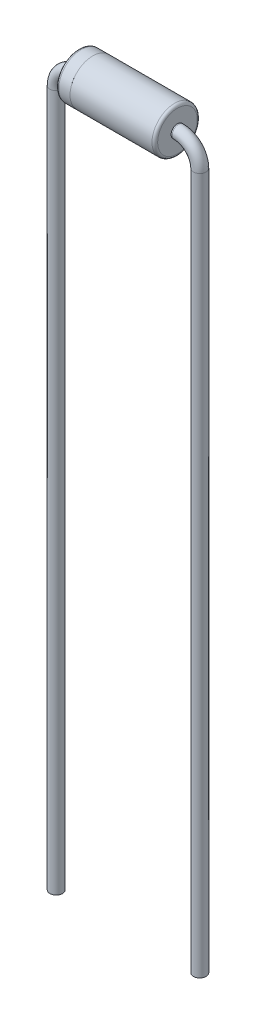
ISO-10303-21;
HEADER;
FILE_DESCRIPTION(('STEP AP214'),'2;1');
FILE_NAME('part.step','',(''),(''),'','','');
FILE_SCHEMA(('AUTOMOTIVE_DESIGN { 1 0 10303 214 1 1 1 1 }'));
ENDSEC;
DATA;
#1=APPLICATION_CONTEXT('core data for automotive mechanical design processes');
#2=APPLICATION_PROTOCOL_DEFINITION('international standard','automotive_design',2000,#1);
#3=PRODUCT_CONTEXT('',#1,'mechanical');
#4=PRODUCT('Part','Part','',(#3));
#5=PRODUCT_RELATED_PRODUCT_CATEGORY('part','',(#4));
#6=PRODUCT_DEFINITION_FORMATION('','',#4);
#7=PRODUCT_DEFINITION_CONTEXT('part definition',#1,'design');
#8=PRODUCT_DEFINITION('design','',#6,#7);
#9=PRODUCT_DEFINITION_SHAPE('','',#8);
#10=(LENGTH_UNIT() NAMED_UNIT(*) SI_UNIT(.MILLI.,.METRE.));
#11=(NAMED_UNIT(*) PLANE_ANGLE_UNIT() SI_UNIT($,.RADIAN.));
#12=(NAMED_UNIT(*) SI_UNIT($,.STERADIAN.) SOLID_ANGLE_UNIT());
#13=UNCERTAINTY_MEASURE_WITH_UNIT(LENGTH_MEASURE(1.E-05),#10,'distance_accuracy_value','');
#14=(GEOMETRIC_REPRESENTATION_CONTEXT(3) GLOBAL_UNCERTAINTY_ASSIGNED_CONTEXT((#13)) GLOBAL_UNIT_ASSIGNED_CONTEXT((#10,
#11,#12)) REPRESENTATION_CONTEXT('',''));
#15=CARTESIAN_POINT('',(0.,0.,0.));
#16=DIRECTION('',(0.,0.,1.));
#17=DIRECTION('',(1.,0.,0.));
#18=AXIS2_PLACEMENT_3D('',#15,#16,#17);
#19=CARTESIAN_POINT('',(-1.25,0.,0.));
#20=DIRECTION('',(1.,0.,0.));
#21=DIRECTION('',(0.,1.,0.));
#22=AXIS2_PLACEMENT_3D('',#19,#20,#21);
#23=PLANE('',#22);
#24=CARTESIAN_POINT('',(-1.25,0.,0.));
#25=DIRECTION('',(1.,0.,0.));
#26=DIRECTION('',(0.,1.,0.));
#27=AXIS2_PLACEMENT_3D('',#24,#25,#26);
#28=CIRCLE('',#27,0.8);
#29=CARTESIAN_POINT('',(-1.25,0.8,0.));
#30=VERTEX_POINT('',#29);
#31=EDGE_CURVE('E11',#30,#30,#28,.T.);
#32=ORIENTED_EDGE('',*,*,#31,.T.);
#33=EDGE_LOOP('',(#32));
#34=FACE_BOUND('',#33,.T.);
#35=ADVANCED_FACE('F45',(#34),#23,.T.);
#36=CARTESIAN_POINT('',(-1.25,0.,0.));
#37=DIRECTION('',(1.,0.,0.));
#38=DIRECTION('',(0.,1.,0.));
#39=AXIS2_PLACEMENT_3D('',#36,#37,#38);
#40=CYLINDRICAL_SURFACE('',#39,0.8);
#41=CARTESIAN_POINT('',(-1.65,0.,0.));
#42=DIRECTION('',(1.,0.,0.));
#43=DIRECTION('',(0.,1.,0.));
#44=AXIS2_PLACEMENT_3D('',#41,#42,#43);
#45=CIRCLE('',#44,0.8);
#46=CARTESIAN_POINT('',(-1.65,0.8,0.));
#47=VERTEX_POINT('',#46);
#48=EDGE_CURVE('E52',#47,#47,#45,.T.);
#49=ORIENTED_EDGE('',*,*,#48,.T.);
#50=EDGE_LOOP('',(#49));
#51=FACE_BOUND('',#50,.T.);
#52=ORIENTED_EDGE('',*,*,#31,.F.);
#53=EDGE_LOOP('',(#52));
#54=FACE_BOUND('',#53,.T.);
#55=ADVANCED_FACE('F116',(#51,#54),#40,.T.);
#56=CARTESIAN_POINT('',(-1.65,0.,0.));
#57=DIRECTION('',(1.,0.,0.));
#58=DIRECTION('',(0.,1.,0.));
#59=AXIS2_PLACEMENT_3D('',#56,#57,#58);
#60=TOROIDAL_SURFACE('',#59,0.7,0.1);
#61=CARTESIAN_POINT('',(-1.75,0.,0.));
#62=DIRECTION('',(1.,0.,0.));
#63=DIRECTION('',(0.,1.,0.));
#64=AXIS2_PLACEMENT_3D('',#61,#62,#63);
#65=CIRCLE('',#64,0.699999999999999);
#66=CARTESIAN_POINT('',(-1.75,0.699999999999999,0.));
#67=VERTEX_POINT('',#66);
#68=EDGE_CURVE('E56',#67,#67,#65,.T.);
#69=ORIENTED_EDGE('',*,*,#68,.T.);
#70=EDGE_LOOP('',(#69));
#71=FACE_BOUND('',#70,.T.);
#72=ORIENTED_EDGE('',*,*,#48,.F.);
#73=EDGE_LOOP('',(#72));
#74=FACE_BOUND('',#73,.T.);
#75=ADVANCED_FACE('F113',(#71,#74),#60,.T.);
#76=CARTESIAN_POINT('',(-1.75,0.,0.));
#77=DIRECTION('',(-1.,0.,0.));
#78=DIRECTION('',(0.,-1.,0.));
#79=AXIS2_PLACEMENT_3D('',#76,#77,#78);
#80=PLANE('',#79);
#81=ORIENTED_EDGE('',*,*,#68,.F.);
#82=EDGE_LOOP('',(#81));
#83=FACE_BOUND('',#82,.T.);
#84=ADVANCED_FACE('F110',(#83),#80,.T.);
#85=CLOSED_SHELL('',(#35,#55,#75,#84));
#86=CARTESIAN_POINT('',(-1.33,0.08,0.));
#87=DIRECTION('',(1.,0.,0.));
#88=DIRECTION('',(0.,1.,0.));
#89=AXIS2_PLACEMENT_3D('',#86,#87,#88);
#90=PLANE('',#89);
#91=CARTESIAN_POINT('',(-1.33,0.,0.));
#92=DIRECTION('',(1.,0.,0.));
#93=DIRECTION('',(0.,1.,0.));
#94=AXIS2_PLACEMENT_3D('',#91,#92,#93);
#95=CIRCLE('',#94,0.72);
#96=CARTESIAN_POINT('',(-1.33,0.72,0.));
#97=VERTEX_POINT('',#96);
#98=EDGE_CURVE('E74',#97,#97,#95,.T.);
#99=ORIENTED_EDGE('',*,*,#98,.F.);
#100=EDGE_LOOP('',(#99));
#101=FACE_BOUND('',#100,.T.);
#102=CARTESIAN_POINT('',(-1.33,0.,0.));
#103=DIRECTION('',(1.,0.,0.));
#104=DIRECTION('',(0.,1.,0.));
#105=AXIS2_PLACEMENT_3D('',#102,#103,#104);
#106=CIRCLE('',#105,0.08);
#107=CARTESIAN_POINT('',(-1.33,0.08,0.));
#108=VERTEX_POINT('',#107);
#109=EDGE_CURVE('E60',#108,#108,#106,.T.);
#110=ORIENTED_EDGE('',*,*,#109,.T.);
#111=EDGE_LOOP('',(#110));
#112=FACE_BOUND('',#111,.T.);
#113=ADVANCED_FACE('F80',(#101,#112),#90,.F.);
#114=CARTESIAN_POINT('',(-1.25,0.,0.));
#115=DIRECTION('',(1.,0.,0.));
#116=DIRECTION('',(0.,1.,0.));
#117=AXIS2_PLACEMENT_3D('',#114,#115,#116);
#118=CYLINDRICAL_SURFACE('',#117,0.08);
#119=ORIENTED_EDGE('',*,*,#109,.F.);
#120=EDGE_LOOP('',(#119));
#121=FACE_BOUND('',#120,.T.);
#122=CARTESIAN_POINT('',(-1.67,0.,0.));
#123=DIRECTION('',(1.,0.,0.));
#124=DIRECTION('',(0.,1.,0.));
#125=AXIS2_PLACEMENT_3D('',#122,#123,#124);
#126=CIRCLE('',#125,0.0800000000000001);
#127=CARTESIAN_POINT('',(-1.67,0.08,0.));
#128=VERTEX_POINT('',#127);
#129=EDGE_CURVE('E65',#128,#128,#126,.T.);
#130=ORIENTED_EDGE('',*,*,#129,.T.);
#131=EDGE_LOOP('',(#130));
#132=FACE_BOUND('',#131,.T.);
#133=ADVANCED_FACE('F83',(#121,#132),#118,.T.);
#134=CARTESIAN_POINT('',(-1.67,0.08,0.));
#135=DIRECTION('',(-1.,0.,0.));
#136=DIRECTION('',(0.,-1.,0.));
#137=AXIS2_PLACEMENT_3D('',#134,#135,#136);
#138=PLANE('',#137);
#139=ORIENTED_EDGE('',*,*,#129,.F.);
#140=EDGE_LOOP('',(#139));
#141=FACE_BOUND('',#140,.T.);
#142=CARTESIAN_POINT('',(-1.67,0.,0.));
#143=DIRECTION('',(1.,0.,0.));
#144=DIRECTION('',(0.,1.,0.));
#145=AXIS2_PLACEMENT_3D('',#142,#143,#144);
#146=CIRCLE('',#145,0.7);
#147=CARTESIAN_POINT('',(-1.67,0.7,0.));
#148=VERTEX_POINT('',#147);
#149=EDGE_CURVE('E68',#148,#148,#146,.T.);
#150=ORIENTED_EDGE('',*,*,#149,.T.);
#151=EDGE_LOOP('',(#150));
#152=FACE_BOUND('',#151,.T.);
#153=ADVANCED_FACE('F90',(#141,#152),#138,.F.);
#154=CARTESIAN_POINT('',(-1.65,0.,0.));
#155=DIRECTION('',(1.,0.,0.));
#156=DIRECTION('',(0.,1.,0.));
#157=AXIS2_PLACEMENT_3D('',#154,#155,#156);
#158=TOROIDAL_SURFACE('',#157,0.7,0.0200000000000001);
#159=ORIENTED_EDGE('',*,*,#149,.F.);
#160=EDGE_LOOP('',(#159));
#161=FACE_BOUND('',#160,.T.);
#162=CARTESIAN_POINT('',(-1.65,0.,0.));
#163=DIRECTION('',(1.,0.,0.));
#164=DIRECTION('',(0.,1.,0.));
#165=AXIS2_PLACEMENT_3D('',#162,#163,#164);
#166=CIRCLE('',#165,0.72);
#167=CARTESIAN_POINT('',(-1.65,0.72,0.));
#168=VERTEX_POINT('',#167);
#169=EDGE_CURVE('E71',#168,#168,#166,.T.);
#170=ORIENTED_EDGE('',*,*,#169,.T.);
#171=EDGE_LOOP('',(#170));
#172=FACE_BOUND('',#171,.T.);
#173=ADVANCED_FACE('F96',(#161,#172),#158,.F.);
#174=CARTESIAN_POINT('',(-1.25,0.,0.));
#175=DIRECTION('',(1.,0.,0.));
#176=DIRECTION('',(0.,1.,0.));
#177=AXIS2_PLACEMENT_3D('',#174,#175,#176);
#178=CYLINDRICAL_SURFACE('',#177,0.72);
#179=ORIENTED_EDGE('',*,*,#169,.F.);
#180=EDGE_LOOP('',(#179));
#181=FACE_BOUND('',#180,.T.);
#182=ORIENTED_EDGE('',*,*,#98,.T.);
#183=EDGE_LOOP('',(#182));
#184=FACE_BOUND('',#183,.T.);
#185=ADVANCED_FACE('F78',(#181,#184),#178,.F.);
#186=CLOSED_SHELL('',(#113,#133,#153,#173,#185));
#187=ORIENTED_CLOSED_SHELL('',*,#186,.T.);
#188=BREP_WITH_VOIDS('B2',#85,(#187));
#189=CARTESIAN_POINT('',(1.75,0.699999999999999,0.));
#190=DIRECTION('',(-1.,0.,0.));
#191=DIRECTION('',(0.,0.,1.));
#192=AXIS2_PLACEMENT_3D('',#189,#190,#191);
#193=PLANE('',#192);
#194=CARTESIAN_POINT('',(1.75,0.,0.));
#195=DIRECTION('',(-1.,0.,0.));
#196=DIRECTION('',(0.,0.,1.));
#197=AXIS2_PLACEMENT_3D('',#194,#195,#196);
#198=CIRCLE('',#197,0.699999999999999);
#199=CARTESIAN_POINT('',(1.75,0.,0.699999999999999));
#200=VERTEX_POINT('',#199);
#201=EDGE_CURVE('E196',#200,#200,#198,.T.);
#202=ORIENTED_EDGE('',*,*,#201,.F.);
#203=EDGE_LOOP('',(#202));
#204=FACE_BOUND('',#203,.T.);
#205=ADVANCED_FACE('F186',(#204),#193,.F.);
#206=CARTESIAN_POINT('',(-1.25,0.,0.));
#207=DIRECTION('',(1.,0.,0.));
#208=DIRECTION('',(0.,0.,-1.));
#209=AXIS2_PLACEMENT_3D('',#206,#207,#208);
#210=PLANE('',#209);
#211=CARTESIAN_POINT('',(-1.25,0.,0.));
#212=DIRECTION('',(-1.,0.,0.));
#213=DIRECTION('',(0.,0.,1.));
#214=AXIS2_PLACEMENT_3D('',#211,#212,#213);
#215=CIRCLE('',#214,0.8);
#216=CARTESIAN_POINT('',(-1.25,0.,0.8));
#217=VERTEX_POINT('',#216);
#218=EDGE_CURVE('E43',#217,#217,#215,.T.);
#219=ORIENTED_EDGE('',*,*,#218,.T.);
#220=EDGE_LOOP('',(#219));
#221=FACE_BOUND('',#220,.T.);
#222=ADVANCED_FACE('F206',(#221),#210,.F.);
#223=CARTESIAN_POINT('',(-1.25,0.,0.));
#224=DIRECTION('',(-1.,0.,0.));
#225=DIRECTION('',(0.,0.,1.));
#226=AXIS2_PLACEMENT_3D('',#223,#224,#225);
#227=CYLINDRICAL_SURFACE('',#226,0.8);
#228=ORIENTED_EDGE('',*,*,#218,.F.);
#229=EDGE_LOOP('',(#228));
#230=FACE_BOUND('',#229,.T.);
#231=CARTESIAN_POINT('',(1.65,0.,0.));
#232=DIRECTION('',(-1.,0.,0.));
#233=DIRECTION('',(0.,0.,1.));
#234=AXIS2_PLACEMENT_3D('',#231,#232,#233);
#235=CIRCLE('',#234,0.8);
#236=CARTESIAN_POINT('',(1.65,0.,0.8));
#237=VERTEX_POINT('',#236);
#238=EDGE_CURVE('E192',#237,#237,#235,.T.);
#239=ORIENTED_EDGE('',*,*,#238,.T.);
#240=EDGE_LOOP('',(#239));
#241=FACE_BOUND('',#240,.T.);
#242=ADVANCED_FACE('F210',(#230,#241),#227,.T.);
#243=CARTESIAN_POINT('',(1.65,0.,0.));
#244=DIRECTION('',(-1.,0.,0.));
#245=DIRECTION('',(0.,0.,1.));
#246=AXIS2_PLACEMENT_3D('',#243,#244,#245);
#247=TOROIDAL_SURFACE('',#246,0.7,0.1);
#248=ORIENTED_EDGE('',*,*,#238,.F.);
#249=EDGE_LOOP('',(#248));
#250=FACE_BOUND('',#249,.T.);
#251=ORIENTED_EDGE('',*,*,#201,.T.);
#252=EDGE_LOOP('',(#251));
#253=FACE_BOUND('',#252,.T.);
#254=ADVANCED_FACE('F203',(#250,#253),#247,.T.);
#255=CLOSED_SHELL('',(#205,#222,#242,#254));
#256=MANIFOLD_SOLID_BREP('B6',#255);
#257=CARTESIAN_POINT('',(1.5,0.4,0.));
#258=DIRECTION('',(-1.,0.,0.));
#259=DIRECTION('',(0.,0.,1.));
#260=AXIS2_PLACEMENT_3D('',#257,#258,#259);
#261=PLANE('',#260);
#262=CARTESIAN_POINT('',(1.5,0.,0.));
#263=DIRECTION('',(-1.,0.,0.));
#264=DIRECTION('',(0.,0.,1.));
#265=AXIS2_PLACEMENT_3D('',#262,#263,#264);
#266=CIRCLE('',#265,0.4);
#267=CARTESIAN_POINT('',(1.5,0.,0.4));
#268=VERTEX_POINT('',#267);
#269=EDGE_CURVE('E185',#268,#268,#266,.T.);
#270=ORIENTED_EDGE('',*,*,#269,.F.);
#271=EDGE_LOOP('',(#270));
#272=FACE_BOUND('',#271,.T.);
#273=ADVANCED_FACE('F249',(#272),#261,.F.);
#274=CARTESIAN_POINT('',(1.4,0.,0.));
#275=DIRECTION('',(-1.,0.,0.));
#276=DIRECTION('',(0.,0.,1.));
#277=AXIS2_PLACEMENT_3D('',#274,#275,#276);
#278=TOROIDAL_SURFACE('',#277,0.4,0.1);
#279=CARTESIAN_POINT('',(1.4,0.,0.));
#280=DIRECTION('',(-1.,0.,0.));
#281=DIRECTION('',(0.,0.,1.));
#282=AXIS2_PLACEMENT_3D('',#279,#280,#281);
#283=CIRCLE('',#282,0.5);
#284=CARTESIAN_POINT('',(1.4,0.,0.5));
#285=VERTEX_POINT('',#284);
#286=EDGE_CURVE('E255',#285,#285,#283,.T.);
#287=ORIENTED_EDGE('',*,*,#286,.F.);
#288=EDGE_LOOP('',(#287));
#289=FACE_BOUND('',#288,.T.);
#290=ORIENTED_EDGE('',*,*,#269,.T.);
#291=EDGE_LOOP('',(#290));
#292=FACE_BOUND('',#291,.T.);
#293=ADVANCED_FACE('F333',(#289,#292),#278,.T.);
#294=CARTESIAN_POINT('',(-1.5,0.,0.));
#295=DIRECTION('',(-1.,0.,0.));
#296=DIRECTION('',(0.,0.,1.));
#297=AXIS2_PLACEMENT_3D('',#294,#295,#296);
#298=CYLINDRICAL_SURFACE('',#297,0.5);
#299=CARTESIAN_POINT('',(0.1,0.,0.));
#300=DIRECTION('',(-1.,0.,0.));
#301=DIRECTION('',(0.,0.,1.));
#302=AXIS2_PLACEMENT_3D('',#299,#300,#301);
#303=CIRCLE('',#302,0.5);
#304=CARTESIAN_POINT('',(0.1,0.,0.5));
#305=VERTEX_POINT('',#304);
#306=EDGE_CURVE('E259',#305,#305,#303,.T.);
#307=ORIENTED_EDGE('',*,*,#306,.F.);
#308=EDGE_LOOP('',(#307));
#309=FACE_BOUND('',#308,.T.);
#310=ORIENTED_EDGE('',*,*,#286,.T.);
#311=EDGE_LOOP('',(#310));
#312=FACE_BOUND('',#311,.T.);
#313=ADVANCED_FACE('F328',(#309,#312),#298,.T.);
#314=CARTESIAN_POINT('',(0.1,0.,0.));
#315=DIRECTION('',(-1.,0.,0.));
#316=DIRECTION('',(0.,0.,1.));
#317=AXIS2_PLACEMENT_3D('',#314,#315,#316);
#318=TOROIDAL_SURFACE('',#317,0.45,0.05);
#319=CARTESIAN_POINT('',(0.0499999999999999,0.,0.));
#320=DIRECTION('',(-1.,0.,0.));
#321=DIRECTION('',(0.,0.,1.));
#322=AXIS2_PLACEMENT_3D('',#319,#320,#321);
#323=CIRCLE('',#322,0.45);
#324=CARTESIAN_POINT('',(0.0499999999999999,0.,0.45));
#325=VERTEX_POINT('',#324);
#326=EDGE_CURVE('E263',#325,#325,#323,.T.);
#327=ORIENTED_EDGE('',*,*,#326,.F.);
#328=EDGE_LOOP('',(#327));
#329=FACE_BOUND('',#328,.T.);
#330=ORIENTED_EDGE('',*,*,#306,.T.);
#331=EDGE_LOOP('',(#330));
#332=FACE_BOUND('',#331,.T.);
#333=ADVANCED_FACE('F322',(#329,#332),#318,.T.);
#334=CARTESIAN_POINT('',(0.05,0.45,0.));
#335=DIRECTION('',(1.,0.,0.));
#336=DIRECTION('',(0.,0.,-1.));
#337=AXIS2_PLACEMENT_3D('',#334,#335,#336);
#338=PLANE('',#337);
#339=CARTESIAN_POINT('',(0.0500000000000001,0.,0.));
#340=DIRECTION('',(-1.,0.,0.));
#341=DIRECTION('',(0.,0.,1.));
#342=AXIS2_PLACEMENT_3D('',#339,#340,#341);
#343=CIRCLE('',#342,0.3);
#344=CARTESIAN_POINT('',(0.0500000000000001,0.,0.3));
#345=VERTEX_POINT('',#344);
#346=EDGE_CURVE('E268',#345,#345,#343,.T.);
#347=ORIENTED_EDGE('',*,*,#346,.F.);
#348=EDGE_LOOP('',(#347));
#349=FACE_BOUND('',#348,.T.);
#350=ORIENTED_EDGE('',*,*,#326,.T.);
#351=EDGE_LOOP('',(#350));
#352=FACE_BOUND('',#351,.T.);
#353=ADVANCED_FACE('F316',(#349,#352),#338,.F.);
#354=CARTESIAN_POINT('',(-1.5,0.,0.));
#355=DIRECTION('',(-1.,0.,0.));
#356=DIRECTION('',(0.,0.,1.));
#357=AXIS2_PLACEMENT_3D('',#354,#355,#356);
#358=CYLINDRICAL_SURFACE('',#357,0.3);
#359=CARTESIAN_POINT('',(-0.0500000000000001,0.,0.));
#360=DIRECTION('',(-1.,0.,0.));
#361=DIRECTION('',(0.,0.,1.));
#362=AXIS2_PLACEMENT_3D('',#359,#360,#361);
#363=CIRCLE('',#362,0.3);
#364=CARTESIAN_POINT('',(-0.0500000000000001,0.,0.3));
#365=VERTEX_POINT('',#364);
#366=EDGE_CURVE('E271',#365,#365,#363,.T.);
#367=ORIENTED_EDGE('',*,*,#366,.F.);
#368=EDGE_LOOP('',(#367));
#369=FACE_BOUND('',#368,.T.);
#370=ORIENTED_EDGE('',*,*,#346,.T.);
#371=EDGE_LOOP('',(#370));
#372=FACE_BOUND('',#371,.T.);
#373=ADVANCED_FACE('F310',(#369,#372),#358,.T.);
#374=CARTESIAN_POINT('',(-0.05,0.45,0.));
#375=DIRECTION('',(-1.,0.,0.));
#376=DIRECTION('',(0.,0.,1.));
#377=AXIS2_PLACEMENT_3D('',#374,#375,#376);
#378=PLANE('',#377);
#379=CARTESIAN_POINT('',(-0.0499999999999999,0.,0.));
#380=DIRECTION('',(-1.,0.,0.));
#381=DIRECTION('',(0.,0.,1.));
#382=AXIS2_PLACEMENT_3D('',#379,#380,#381);
#383=CIRCLE('',#382,0.45);
#384=CARTESIAN_POINT('',(-0.0499999999999999,0.,0.45));
#385=VERTEX_POINT('',#384);
#386=EDGE_CURVE('E274',#385,#385,#383,.T.);
#387=ORIENTED_EDGE('',*,*,#386,.F.);
#388=EDGE_LOOP('',(#387));
#389=FACE_BOUND('',#388,.T.);
#390=ORIENTED_EDGE('',*,*,#366,.T.);
#391=EDGE_LOOP('',(#390));
#392=FACE_BOUND('',#391,.T.);
#393=ADVANCED_FACE('F304',(#389,#392),#378,.F.);
#394=CARTESIAN_POINT('',(-0.1,0.,0.));
#395=DIRECTION('',(-1.,0.,0.));
#396=DIRECTION('',(0.,0.,1.));
#397=AXIS2_PLACEMENT_3D('',#394,#395,#396);
#398=TOROIDAL_SURFACE('',#397,0.45,0.05);
#399=CARTESIAN_POINT('',(-0.1,0.,0.));
#400=DIRECTION('',(-1.,0.,0.));
#401=DIRECTION('',(0.,0.,1.));
#402=AXIS2_PLACEMENT_3D('',#399,#400,#401);
#403=CIRCLE('',#402,0.5);
#404=CARTESIAN_POINT('',(-0.1,0.,0.5));
#405=VERTEX_POINT('',#404);
#406=EDGE_CURVE('E277',#405,#405,#403,.T.);
#407=ORIENTED_EDGE('',*,*,#406,.F.);
#408=EDGE_LOOP('',(#407));
#409=FACE_BOUND('',#408,.T.);
#410=ORIENTED_EDGE('',*,*,#386,.T.);
#411=EDGE_LOOP('',(#410));
#412=FACE_BOUND('',#411,.T.);
#413=ADVANCED_FACE('F298',(#409,#412),#398,.T.);
#414=CARTESIAN_POINT('',(-1.5,0.,0.));
#415=DIRECTION('',(-1.,0.,0.));
#416=DIRECTION('',(0.,0.,1.));
#417=AXIS2_PLACEMENT_3D('',#414,#415,#416);
#418=CYLINDRICAL_SURFACE('',#417,0.5);
#419=CARTESIAN_POINT('',(-1.4,0.,0.));
#420=DIRECTION('',(-1.,0.,0.));
#421=DIRECTION('',(0.,0.,1.));
#422=AXIS2_PLACEMENT_3D('',#419,#420,#421);
#423=CIRCLE('',#422,0.5);
#424=CARTESIAN_POINT('',(-1.4,0.,0.5));
#425=VERTEX_POINT('',#424);
#426=EDGE_CURVE('E280',#425,#425,#423,.T.);
#427=ORIENTED_EDGE('',*,*,#426,.F.);
#428=EDGE_LOOP('',(#427));
#429=FACE_BOUND('',#428,.T.);
#430=ORIENTED_EDGE('',*,*,#406,.T.);
#431=EDGE_LOOP('',(#430));
#432=FACE_BOUND('',#431,.T.);
#433=ADVANCED_FACE('F292',(#429,#432),#418,.T.);
#434=CARTESIAN_POINT('',(-1.4,0.,0.));
#435=DIRECTION('',(-1.,0.,0.));
#436=DIRECTION('',(0.,0.,1.));
#437=AXIS2_PLACEMENT_3D('',#434,#435,#436);
#438=TOROIDAL_SURFACE('',#437,0.4,0.1);
#439=CARTESIAN_POINT('',(-1.5,0.,0.));
#440=DIRECTION('',(-1.,0.,0.));
#441=DIRECTION('',(0.,0.,1.));
#442=AXIS2_PLACEMENT_3D('',#439,#440,#441);
#443=CIRCLE('',#442,0.4);
#444=CARTESIAN_POINT('',(-1.5,0.,0.4));
#445=VERTEX_POINT('',#444);
#446=EDGE_CURVE('E283',#445,#445,#443,.T.);
#447=ORIENTED_EDGE('',*,*,#446,.F.);
#448=EDGE_LOOP('',(#447));
#449=FACE_BOUND('',#448,.T.);
#450=ORIENTED_EDGE('',*,*,#426,.T.);
#451=EDGE_LOOP('',(#450));
#452=FACE_BOUND('',#451,.T.);
#453=ADVANCED_FACE('F289',(#449,#452),#438,.T.);
#454=CARTESIAN_POINT('',(-1.5,0.4,0.));
#455=DIRECTION('',(1.,0.,0.));
#456=DIRECTION('',(0.,0.,-1.));
#457=AXIS2_PLACEMENT_3D('',#454,#455,#456);
#458=PLANE('',#457);
#459=ORIENTED_EDGE('',*,*,#446,.T.);
#460=EDGE_LOOP('',(#459));
#461=FACE_BOUND('',#460,.T.);
#462=ADVANCED_FACE('F287',(#461),#458,.F.);
#463=CLOSED_SHELL('',(#273,#293,#313,#333,#353,#373,#393,#413,#433,#453,#462));
#464=MANIFOLD_SOLID_BREP('B38',#463);
#465=CARTESIAN_POINT('',(2.54000000000001,-25.4,0.));
#466=DIRECTION('',(0.,1.,0.));
#467=DIRECTION('',(-1.,0.,0.));
#468=AXIS2_PLACEMENT_3D('',#465,#466,#467);
#469=PLANE('',#468);
#470=CARTESIAN_POINT('',(2.54000000000001,-25.4,0.));
#471=DIRECTION('',(0.,1.,0.));
#472=DIRECTION('',(-1.,0.,0.));
#473=AXIS2_PLACEMENT_3D('',#470,#471,#472);
#474=CIRCLE('',#473,0.225);
#475=CARTESIAN_POINT('',(2.31500000000001,-25.4,0.));
#476=VERTEX_POINT('',#475);
#477=EDGE_CURVE('E432',#476,#476,#474,.T.);
#478=ORIENTED_EDGE('',*,*,#477,.F.);
#479=EDGE_LOOP('',(#478));
#480=FACE_BOUND('',#479,.T.);
#481=ADVANCED_FACE('F410',(#480),#469,.F.);
#482=CARTESIAN_POINT('',(-2.54,-25.4,0.));
#483=DIRECTION('',(0.,-1.,0.));
#484=DIRECTION('',(1.,0.,0.));
#485=AXIS2_PLACEMENT_3D('',#482,#483,#484);
#486=PLANE('',#485);
#487=CARTESIAN_POINT('',(-2.54,-25.4,0.));
#488=DIRECTION('',(0.,-1.,0.));
#489=DIRECTION('',(1.,0.,0.));
#490=AXIS2_PLACEMENT_3D('',#487,#488,#489);
#491=CIRCLE('',#490,0.225);
#492=CARTESIAN_POINT('',(-2.315,-25.4,0.));
#493=VERTEX_POINT('',#492);
#494=EDGE_CURVE('E248',#493,#493,#491,.T.);
#495=ORIENTED_EDGE('',*,*,#494,.T.);
#496=EDGE_LOOP('',(#495));
#497=FACE_BOUND('',#496,.T.);
#498=ADVANCED_FACE('F439',(#497),#486,.T.);
#499=CARTESIAN_POINT('',(2.54000000000001,-25.4,0.));
#500=DIRECTION('',(0.,1.,0.));
#501=DIRECTION('',(-1.,0.,0.));
#502=AXIS2_PLACEMENT_3D('',#499,#500,#501);
#503=CYLINDRICAL_SURFACE('',#502,0.225);
#504=CARTESIAN_POINT('',(2.54,-0.750000000000001,0.));
#505=DIRECTION('',(0.,1.,0.));
#506=DIRECTION('',(-1.,0.,0.));
#507=AXIS2_PLACEMENT_3D('',#504,#505,#506);
#508=CIRCLE('',#507,0.225);
#509=CARTESIAN_POINT('',(2.765,-0.750000000000001,0.));
#510=VERTEX_POINT('',#509);
#511=EDGE_CURVE('E429',#510,#510,#508,.T.);
#512=ORIENTED_EDGE('',*,*,#511,.F.);
#513=EDGE_LOOP('',(#512));
#514=FACE_BOUND('',#513,.T.);
#515=ORIENTED_EDGE('',*,*,#477,.T.);
#516=EDGE_LOOP('',(#515));
#517=FACE_BOUND('',#516,.T.);
#518=ADVANCED_FACE('F436',(#514,#517),#503,.T.);
#519=CARTESIAN_POINT('',(1.79,-0.75,0.));
#520=DIRECTION('',(0.,0.,1.));
#521=DIRECTION('',(1.,0.,0.));
#522=AXIS2_PLACEMENT_3D('',#519,#520,#521);
#523=TOROIDAL_SURFACE('',#522,0.75,0.225);
#524=CARTESIAN_POINT('',(1.79,0.,0.));
#525=DIRECTION('',(-1.,0.,0.));
#526=DIRECTION('',(0.,-1.,0.));
#527=AXIS2_PLACEMENT_3D('',#524,#525,#526);
#528=CIRCLE('',#527,0.225);
#529=CARTESIAN_POINT('',(1.79,0.225,0.));
#530=VERTEX_POINT('',#529);
#531=EDGE_CURVE('E424',#530,#530,#528,.T.);
#532=CARTESIAN_POINT('',(1.79,-0.75,0.));
#533=DIRECTION('',(0.,0.,1.));
#534=DIRECTION('',(1.,0.,0.));
#535=AXIS2_PLACEMENT_3D('',#532,#533,#534);
#536=CIRCLE('',#535,0.975);
#537=EDGE_CURVE('',#510,#530,#536,.T.);
#538=ORIENTED_EDGE('',*,*,#511,.T.);
#539=ORIENTED_EDGE('',*,*,#531,.F.);
#540=ORIENTED_EDGE('',*,*,#537,.T.);
#541=ORIENTED_EDGE('',*,*,#537,.F.);
#542=EDGE_LOOP('',(#538,#540,#539,#541));
#543=FACE_BOUND('',#542,.T.);
#544=ADVANCED_FACE('F457',(#543),#523,.T.);
#545=CARTESIAN_POINT('',(1.79,0.,0.));
#546=DIRECTION('',(-1.,0.,0.));
#547=DIRECTION('',(0.,0.,1.));
#548=AXIS2_PLACEMENT_3D('',#545,#546,#547);
#549=CYLINDRICAL_SURFACE('',#548,0.225);
#550=CARTESIAN_POINT('',(-1.79,0.,0.));
#551=DIRECTION('',(-1.,0.,0.));
#552=DIRECTION('',(0.,-1.,0.));
#553=AXIS2_PLACEMENT_3D('',#550,#551,#552);
#554=CIRCLE('',#553,0.225);
#555=CARTESIAN_POINT('',(-1.79,0.225,0.));
#556=VERTEX_POINT('',#555);
#557=EDGE_CURVE('E420',#556,#556,#554,.T.);
#558=ORIENTED_EDGE('',*,*,#557,.F.);
#559=EDGE_LOOP('',(#558));
#560=FACE_BOUND('',#559,.T.);
#561=ORIENTED_EDGE('',*,*,#531,.T.);
#562=EDGE_LOOP('',(#561));
#563=FACE_BOUND('',#562,.T.);
#564=ADVANCED_FACE('F451',(#560,#563),#549,.T.);
#565=CARTESIAN_POINT('',(-1.79,-0.75,0.));
#566=DIRECTION('',(0.,0.,1.));
#567=DIRECTION('',(1.,0.,0.));
#568=AXIS2_PLACEMENT_3D('',#565,#566,#567);
#569=TOROIDAL_SURFACE('',#568,0.75,0.225);
#570=CARTESIAN_POINT('',(-2.54,-0.750000000000001,0.));
#571=DIRECTION('',(0.,-1.,0.));
#572=DIRECTION('',(1.,0.,0.));
#573=AXIS2_PLACEMENT_3D('',#570,#571,#572);
#574=CIRCLE('',#573,0.225);
#575=CARTESIAN_POINT('',(-2.765,-0.750000000000001,0.));
#576=VERTEX_POINT('',#575);
#577=EDGE_CURVE('E416',#576,#576,#574,.T.);
#578=CARTESIAN_POINT('',(-1.79,-0.75,0.));
#579=DIRECTION('',(0.,0.,1.));
#580=DIRECTION('',(1.,0.,0.));
#581=AXIS2_PLACEMENT_3D('',#578,#579,#580);
#582=CIRCLE('',#581,0.975);
#583=EDGE_CURVE('',#556,#576,#582,.T.);
#584=ORIENTED_EDGE('',*,*,#557,.T.);
#585=ORIENTED_EDGE('',*,*,#577,.F.);
#586=ORIENTED_EDGE('',*,*,#583,.T.);
#587=ORIENTED_EDGE('',*,*,#583,.F.);
#588=EDGE_LOOP('',(#584,#586,#585,#587));
#589=FACE_BOUND('',#588,.T.);
#590=ADVANCED_FACE('F445',(#589),#569,.T.);
#591=CARTESIAN_POINT('',(-2.54,-0.750000000000001,0.));
#592=DIRECTION('',(0.,-1.,0.));
#593=DIRECTION('',(1.,0.,0.));
#594=AXIS2_PLACEMENT_3D('',#591,#592,#593);
#595=CYLINDRICAL_SURFACE('',#594,0.225);
#596=ORIENTED_EDGE('',*,*,#494,.F.);
#597=EDGE_LOOP('',(#596));
#598=FACE_BOUND('',#597,.T.);
#599=ORIENTED_EDGE('',*,*,#577,.T.);
#600=EDGE_LOOP('',(#599));
#601=FACE_BOUND('',#600,.T.);
#602=ADVANCED_FACE('F443',(#598,#601),#595,.T.);
#603=CLOSED_SHELL('',(#481,#498,#518,#544,#564,#590,#602));
#604=MANIFOLD_SOLID_BREP('B180',#603);
#605=ADVANCED_BREP_SHAPE_REPRESENTATION('',(#18,#188,#256,#464,#604),#14);
#606=SHAPE_DEFINITION_REPRESENTATION(#9,#605);
ENDSEC;
END-ISO-10303-21;
